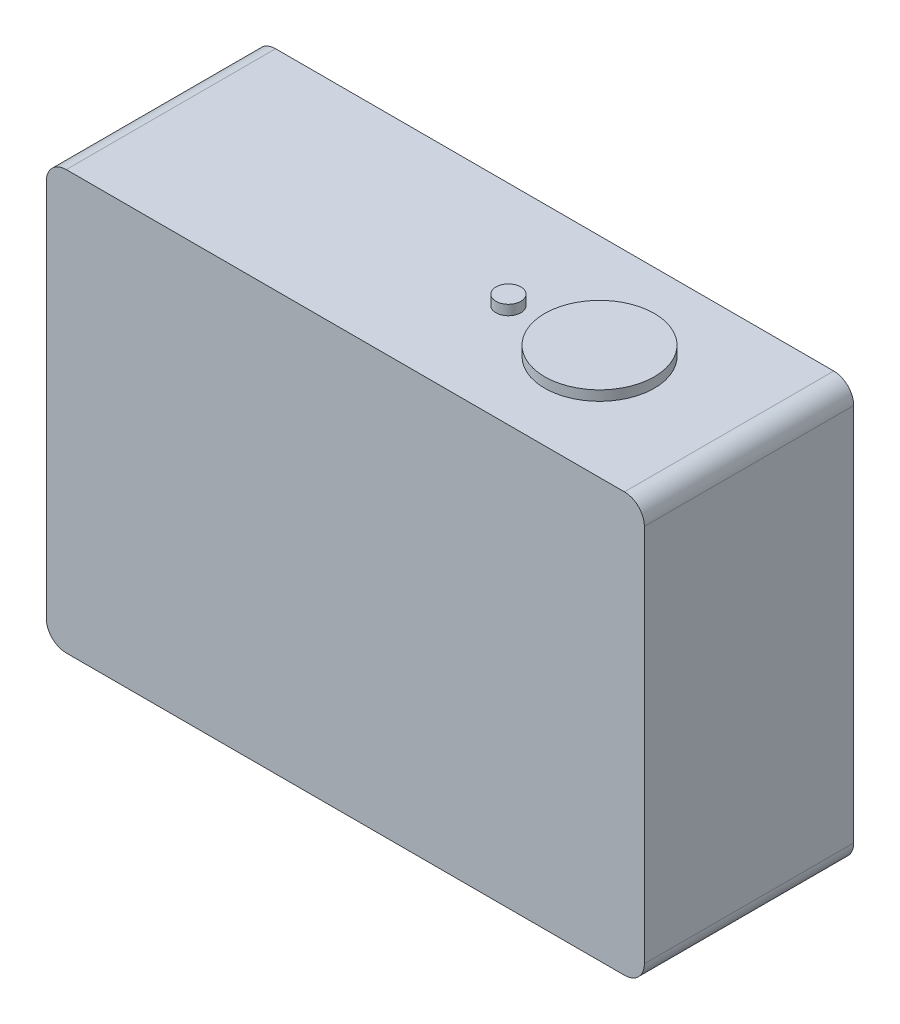
ISO-10303-21;
HEADER;
FILE_DESCRIPTION(('STEP AP214'),'2;1');
FILE_NAME('part.step','',(''),(''),'','','');
FILE_SCHEMA(('AUTOMOTIVE_DESIGN { 1 0 10303 214 1 1 1 1 }'));
ENDSEC;
DATA;
#1=APPLICATION_CONTEXT('core data for automotive mechanical design processes');
#2=APPLICATION_PROTOCOL_DEFINITION('international standard','automotive_design',2000,#1);
#3=PRODUCT_CONTEXT('',#1,'mechanical');
#4=PRODUCT('Part','Part','',(#3));
#5=PRODUCT_RELATED_PRODUCT_CATEGORY('part','',(#4));
#6=PRODUCT_DEFINITION_FORMATION('','',#4);
#7=PRODUCT_DEFINITION_CONTEXT('part definition',#1,'design');
#8=PRODUCT_DEFINITION('design','',#6,#7);
#9=PRODUCT_DEFINITION_SHAPE('','',#8);
#10=(LENGTH_UNIT() NAMED_UNIT(*) SI_UNIT(.MILLI.,.METRE.));
#11=(NAMED_UNIT(*) PLANE_ANGLE_UNIT() SI_UNIT($,.RADIAN.));
#12=(NAMED_UNIT(*) SI_UNIT($,.STERADIAN.) SOLID_ANGLE_UNIT());
#13=UNCERTAINTY_MEASURE_WITH_UNIT(LENGTH_MEASURE(1.E-05),#10,'distance_accuracy_value','');
#14=(GEOMETRIC_REPRESENTATION_CONTEXT(3) GLOBAL_UNCERTAINTY_ASSIGNED_CONTEXT((#13)) GLOBAL_UNIT_ASSIGNED_CONTEXT((#10,
#11,#12)) REPRESENTATION_CONTEXT('',''));
#15=CARTESIAN_POINT('',(0.,0.,0.));
#16=DIRECTION('',(0.,0.,1.));
#17=DIRECTION('',(1.,0.,0.));
#18=AXIS2_PLACEMENT_3D('',#15,#16,#17);
#19=CARTESIAN_POINT('',(30.,-21.,21.));
#20=DIRECTION('',(-1.,0.,0.));
#21=DIRECTION('',(0.,0.,1.));
#22=AXIS2_PLACEMENT_3D('',#19,#20,#21);
#23=PLANE('',#22);
#24=DIRECTION('',(0.,1.,0.));
#25=VECTOR('',#24,1.);
#26=CARTESIAN_POINT('',(30.,-21.,21.));
#27=LINE('',#26,#25);
#28=CARTESIAN_POINT('',(30.,-19.,21.));
#29=VERTEX_POINT('',#28);
#30=CARTESIAN_POINT('',(30.,19.,21.));
#31=VERTEX_POINT('',#30);
#32=EDGE_CURVE('E128',#29,#31,#27,.T.);
#33=ORIENTED_EDGE('',*,*,#32,.F.);
#34=DIRECTION('',(0.,0.,-1.));
#35=VECTOR('',#34,1.);
#36=CARTESIAN_POINT('',(30.,-19.,21.));
#37=LINE('',#36,#35);
#38=CARTESIAN_POINT('',(30.,-19.,0.));
#39=VERTEX_POINT('',#38);
#40=EDGE_CURVE('E154',#29,#39,#37,.T.);
#41=ORIENTED_EDGE('',*,*,#40,.T.);
#42=DIRECTION('',(0.,1.,0.));
#43=VECTOR('',#42,1.);
#44=CARTESIAN_POINT('',(30.,-21.,0.));
#45=LINE('',#44,#43);
#46=CARTESIAN_POINT('',(30.,19.,0.));
#47=VERTEX_POINT('',#46);
#48=EDGE_CURVE('E186',#39,#47,#45,.T.);
#49=ORIENTED_EDGE('',*,*,#48,.T.);
#50=DIRECTION('',(0.,0.,-1.));
#51=VECTOR('',#50,1.);
#52=CARTESIAN_POINT('',(30.,19.,21.));
#53=LINE('',#52,#51);
#54=EDGE_CURVE('E152',#47,#31,#53,.F.);
#55=ORIENTED_EDGE('',*,*,#54,.T.);
#56=EDGE_LOOP('',(#33,#41,#49,#55));
#57=FACE_BOUND('',#56,.T.);
#58=ADVANCED_FACE('F35',(#57),#23,.F.);
#59=CARTESIAN_POINT('',(-30.,21.,21.));
#60=DIRECTION('',(0.,-1.,0.));
#61=DIRECTION('',(0.,0.,-1.));
#62=AXIS2_PLACEMENT_3D('',#59,#60,#61);
#63=PLANE('',#62);
#64=CARTESIAN_POINT('',(6.,21.,10.6398914084365));
#65=DIRECTION('',(0.,-1.,0.));
#66=DIRECTION('',(0.,0.,-1.));
#67=AXIS2_PLACEMENT_3D('',#64,#65,#66);
#68=CIRCLE('',#67,1.25);
#69=CARTESIAN_POINT('',(6.,21.,9.38989140843655));
#70=VERTEX_POINT('',#69);
#71=EDGE_CURVE('E43',#70,#70,#68,.F.);
#72=ORIENTED_EDGE('',*,*,#71,.F.);
#73=EDGE_LOOP('',(#72));
#74=FACE_BOUND('',#73,.T.);
#75=CARTESIAN_POINT('',(15.,21.,10.5));
#76=DIRECTION('',(0.,-1.,0.));
#77=DIRECTION('',(0.,0.,-1.));
#78=AXIS2_PLACEMENT_3D('',#75,#76,#77);
#79=CIRCLE('',#78,5.5);
#80=CARTESIAN_POINT('',(15.,21.,5.));
#81=VERTEX_POINT('',#80);
#82=EDGE_CURVE('E164',#81,#81,#79,.F.);
#83=ORIENTED_EDGE('',*,*,#82,.F.);
#84=EDGE_LOOP('',(#83));
#85=FACE_BOUND('',#84,.T.);
#86=DIRECTION('',(-1.,0.,0.));
#87=VECTOR('',#86,1.);
#88=CARTESIAN_POINT('',(-30.,21.,21.));
#89=LINE('',#88,#87);
#90=CARTESIAN_POINT('',(28.,21.,21.));
#91=VERTEX_POINT('',#90);
#92=CARTESIAN_POINT('',(-28.,21.,21.));
#93=VERTEX_POINT('',#92);
#94=EDGE_CURVE('E131',#91,#93,#89,.T.);
#95=ORIENTED_EDGE('',*,*,#94,.F.);
#96=DIRECTION('',(0.,0.,-1.));
#97=VECTOR('',#96,1.);
#98=CARTESIAN_POINT('',(28.,21.,21.));
#99=LINE('',#98,#97);
#100=CARTESIAN_POINT('',(28.,21.,0.));
#101=VERTEX_POINT('',#100);
#102=EDGE_CURVE('E158',#91,#101,#99,.T.);
#103=ORIENTED_EDGE('',*,*,#102,.T.);
#104=DIRECTION('',(-1.,0.,0.));
#105=VECTOR('',#104,1.);
#106=CARTESIAN_POINT('',(-30.,21.,0.));
#107=LINE('',#106,#105);
#108=CARTESIAN_POINT('',(-28.,21.,0.));
#109=VERTEX_POINT('',#108);
#110=EDGE_CURVE('E133',#101,#109,#107,.T.);
#111=ORIENTED_EDGE('',*,*,#110,.T.);
#112=DIRECTION('',(0.,0.,-1.));
#113=VECTOR('',#112,1.);
#114=CARTESIAN_POINT('',(-28.,21.,21.));
#115=LINE('',#114,#113);
#116=EDGE_CURVE('E50',#109,#93,#115,.F.);
#117=ORIENTED_EDGE('',*,*,#116,.T.);
#118=EDGE_LOOP('',(#95,#103,#111,#117));
#119=FACE_BOUND('',#118,.T.);
#120=ADVANCED_FACE('F171',(#74,#85,#119),#63,.F.);
#121=CARTESIAN_POINT('',(-30.,-21.,21.));
#122=DIRECTION('',(1.,0.,0.));
#123=DIRECTION('',(0.,0.,-1.));
#124=AXIS2_PLACEMENT_3D('',#121,#122,#123);
#125=PLANE('',#124);
#126=DIRECTION('',(0.,-1.,0.));
#127=VECTOR('',#126,1.);
#128=CARTESIAN_POINT('',(-30.,-21.,0.));
#129=LINE('',#128,#127);
#130=CARTESIAN_POINT('',(-30.,19.,0.));
#131=VERTEX_POINT('',#130);
#132=CARTESIAN_POINT('',(-30.,-19.,0.));
#133=VERTEX_POINT('',#132);
#134=EDGE_CURVE('E129',#131,#133,#129,.T.);
#135=ORIENTED_EDGE('',*,*,#134,.T.);
#136=DIRECTION('',(0.,0.,-1.));
#137=VECTOR('',#136,1.);
#138=CARTESIAN_POINT('',(-30.,-19.,21.));
#139=LINE('',#138,#137);
#140=CARTESIAN_POINT('',(-30.,-19.,21.));
#141=VERTEX_POINT('',#140);
#142=EDGE_CURVE('E107',#133,#141,#139,.F.);
#143=ORIENTED_EDGE('',*,*,#142,.T.);
#144=DIRECTION('',(0.,-1.,0.));
#145=VECTOR('',#144,1.);
#146=CARTESIAN_POINT('',(-30.,-21.,21.));
#147=LINE('',#146,#145);
#148=CARTESIAN_POINT('',(-30.,19.,21.));
#149=VERTEX_POINT('',#148);
#150=EDGE_CURVE('E180',#149,#141,#147,.T.);
#151=ORIENTED_EDGE('',*,*,#150,.F.);
#152=DIRECTION('',(0.,0.,-1.));
#153=VECTOR('',#152,1.);
#154=CARTESIAN_POINT('',(-30.,19.,21.));
#155=LINE('',#154,#153);
#156=EDGE_CURVE('E112',#149,#131,#155,.T.);
#157=ORIENTED_EDGE('',*,*,#156,.T.);
#158=EDGE_LOOP('',(#135,#143,#151,#157));
#159=FACE_BOUND('',#158,.T.);
#160=ADVANCED_FACE('F174',(#159),#125,.F.);
#161=CARTESIAN_POINT('',(-30.,-21.,21.));
#162=DIRECTION('',(0.,1.,0.));
#163=DIRECTION('',(0.,0.,1.));
#164=AXIS2_PLACEMENT_3D('',#161,#162,#163);
#165=PLANE('',#164);
#166=DIRECTION('',(1.,0.,0.));
#167=VECTOR('',#166,1.);
#168=CARTESIAN_POINT('',(-30.,-21.,21.));
#169=LINE('',#168,#167);
#170=CARTESIAN_POINT('',(-28.,-21.,21.));
#171=VERTEX_POINT('',#170);
#172=CARTESIAN_POINT('',(28.,-21.,21.));
#173=VERTEX_POINT('',#172);
#174=EDGE_CURVE('E122',#171,#173,#169,.T.);
#175=ORIENTED_EDGE('',*,*,#174,.F.);
#176=DIRECTION('',(0.,0.,-1.));
#177=VECTOR('',#176,1.);
#178=CARTESIAN_POINT('',(-28.,-21.,21.));
#179=LINE('',#178,#177);
#180=CARTESIAN_POINT('',(-28.,-21.,0.));
#181=VERTEX_POINT('',#180);
#182=EDGE_CURVE('E106',#171,#181,#179,.T.);
#183=ORIENTED_EDGE('',*,*,#182,.T.);
#184=DIRECTION('',(1.,0.,0.));
#185=VECTOR('',#184,1.);
#186=CARTESIAN_POINT('',(-30.,-21.,0.));
#187=LINE('',#186,#185);
#188=CARTESIAN_POINT('',(28.,-21.,0.));
#189=VERTEX_POINT('',#188);
#190=EDGE_CURVE('E119',#181,#189,#187,.T.);
#191=ORIENTED_EDGE('',*,*,#190,.T.);
#192=DIRECTION('',(0.,0.,-1.));
#193=VECTOR('',#192,1.);
#194=CARTESIAN_POINT('',(28.,-21.,21.));
#195=LINE('',#194,#193);
#196=EDGE_CURVE('E124',#189,#173,#195,.F.);
#197=ORIENTED_EDGE('',*,*,#196,.T.);
#198=EDGE_LOOP('',(#175,#183,#191,#197));
#199=FACE_BOUND('',#198,.T.);
#200=ADVANCED_FACE('F118',(#199),#165,.F.);
#201=CARTESIAN_POINT('',(0.,0.,21.));
#202=DIRECTION('',(0.,0.,-1.));
#203=DIRECTION('',(-1.,0.,0.));
#204=AXIS2_PLACEMENT_3D('',#201,#202,#203);
#205=PLANE('',#204);
#206=ORIENTED_EDGE('',*,*,#150,.T.);
#207=CARTESIAN_POINT('',(-28.,-19.,21.));
#208=DIRECTION('',(0.,0.,-1.));
#209=DIRECTION('',(-1.,0.,0.));
#210=AXIS2_PLACEMENT_3D('',#207,#208,#209);
#211=CIRCLE('',#210,2.);
#212=EDGE_CURVE('E150',#141,#171,#211,.F.);
#213=ORIENTED_EDGE('',*,*,#212,.T.);
#214=ORIENTED_EDGE('',*,*,#174,.T.);
#215=CARTESIAN_POINT('',(28.,-19.,21.));
#216=DIRECTION('',(0.,0.,-1.));
#217=DIRECTION('',(-1.,0.,0.));
#218=AXIS2_PLACEMENT_3D('',#215,#216,#217);
#219=CIRCLE('',#218,2.);
#220=EDGE_CURVE('E148',#173,#29,#219,.F.);
#221=ORIENTED_EDGE('',*,*,#220,.T.);
#222=ORIENTED_EDGE('',*,*,#32,.T.);
#223=CARTESIAN_POINT('',(28.,19.,21.));
#224=DIRECTION('',(0.,0.,-1.));
#225=DIRECTION('',(-1.,0.,0.));
#226=AXIS2_PLACEMENT_3D('',#223,#224,#225);
#227=CIRCLE('',#226,2.);
#228=EDGE_CURVE('E57',#31,#91,#227,.F.);
#229=ORIENTED_EDGE('',*,*,#228,.T.);
#230=ORIENTED_EDGE('',*,*,#94,.T.);
#231=CARTESIAN_POINT('',(-28.,19.,21.));
#232=DIRECTION('',(0.,0.,-1.));
#233=DIRECTION('',(-1.,0.,0.));
#234=AXIS2_PLACEMENT_3D('',#231,#232,#233);
#235=CIRCLE('',#234,2.);
#236=EDGE_CURVE('E145',#93,#149,#235,.F.);
#237=ORIENTED_EDGE('',*,*,#236,.T.);
#238=EDGE_LOOP('',(#206,#213,#214,#221,#222,#229,#230,#237));
#239=FACE_BOUND('',#238,.T.);
#240=ADVANCED_FACE('F253',(#239),#205,.F.);
#241=CARTESIAN_POINT('',(0.,0.,0.));
#242=DIRECTION('',(0.,0.,-1.));
#243=DIRECTION('',(-1.,0.,0.));
#244=AXIS2_PLACEMENT_3D('',#241,#242,#243);
#245=PLANE('',#244);
#246=CARTESIAN_POINT('',(15.,0.,0.));
#247=DIRECTION('',(0.,0.,-1.));
#248=DIRECTION('',(-1.,0.,0.));
#249=AXIS2_PLACEMENT_3D('',#246,#247,#248);
#250=CIRCLE('',#249,7.41919465019523);
#251=CARTESIAN_POINT('',(7.58080534980477,0.,0.));
#252=VERTEX_POINT('',#251);
#253=EDGE_CURVE('E161',#252,#252,#250,.T.);
#254=ORIENTED_EDGE('',*,*,#253,.F.);
#255=EDGE_LOOP('',(#254));
#256=FACE_BOUND('',#255,.T.);
#257=CARTESIAN_POINT('',(-13.,0.,0.));
#258=DIRECTION('',(0.,0.,-1.));
#259=DIRECTION('',(-1.,0.,0.));
#260=AXIS2_PLACEMENT_3D('',#257,#258,#259);
#261=CIRCLE('',#260,11.875268611466);
#262=CARTESIAN_POINT('',(-24.875268611466,0.,0.));
#263=VERTEX_POINT('',#262);
#264=EDGE_CURVE('E193',#263,#263,#261,.T.);
#265=ORIENTED_EDGE('',*,*,#264,.F.);
#266=EDGE_LOOP('',(#265));
#267=FACE_BOUND('',#266,.T.);
#268=ORIENTED_EDGE('',*,*,#190,.F.);
#269=CARTESIAN_POINT('',(-28.,-19.,0.));
#270=DIRECTION('',(0.,0.,-1.));
#271=DIRECTION('',(-1.,0.,0.));
#272=AXIS2_PLACEMENT_3D('',#269,#270,#271);
#273=CIRCLE('',#272,2.);
#274=EDGE_CURVE('E102',#181,#133,#273,.T.);
#275=ORIENTED_EDGE('',*,*,#274,.T.);
#276=ORIENTED_EDGE('',*,*,#134,.F.);
#277=CARTESIAN_POINT('',(-28.,19.,0.));
#278=DIRECTION('',(0.,0.,-1.));
#279=DIRECTION('',(-1.,0.,0.));
#280=AXIS2_PLACEMENT_3D('',#277,#278,#279);
#281=CIRCLE('',#280,2.);
#282=EDGE_CURVE('E123',#131,#109,#281,.T.);
#283=ORIENTED_EDGE('',*,*,#282,.T.);
#284=ORIENTED_EDGE('',*,*,#110,.F.);
#285=CARTESIAN_POINT('',(28.,19.,0.));
#286=DIRECTION('',(0.,0.,-1.));
#287=DIRECTION('',(-1.,0.,0.));
#288=AXIS2_PLACEMENT_3D('',#285,#286,#287);
#289=CIRCLE('',#288,2.);
#290=EDGE_CURVE('E139',#101,#47,#289,.T.);
#291=ORIENTED_EDGE('',*,*,#290,.T.);
#292=ORIENTED_EDGE('',*,*,#48,.F.);
#293=CARTESIAN_POINT('',(28.,-19.,0.));
#294=DIRECTION('',(0.,0.,-1.));
#295=DIRECTION('',(-1.,0.,0.));
#296=AXIS2_PLACEMENT_3D('',#293,#294,#295);
#297=CIRCLE('',#296,2.);
#298=EDGE_CURVE('E113',#39,#189,#297,.T.);
#299=ORIENTED_EDGE('',*,*,#298,.T.);
#300=EDGE_LOOP('',(#268,#275,#276,#283,#284,#291,#292,#299));
#301=FACE_BOUND('',#300,.T.);
#302=ADVANCED_FACE('F126',(#256,#267,#301),#245,.T.);
#303=CARTESIAN_POINT('',(-28.,-19.,21.));
#304=DIRECTION('',(0.,0.,-1.));
#305=DIRECTION('',(-1.,0.,0.));
#306=AXIS2_PLACEMENT_3D('',#303,#304,#305);
#307=CYLINDRICAL_SURFACE('',#306,2.);
#308=ORIENTED_EDGE('',*,*,#212,.F.);
#309=ORIENTED_EDGE('',*,*,#142,.F.);
#310=ORIENTED_EDGE('',*,*,#274,.F.);
#311=ORIENTED_EDGE('',*,*,#182,.F.);
#312=EDGE_LOOP('',(#308,#309,#310,#311));
#313=FACE_BOUND('',#312,.T.);
#314=ADVANCED_FACE('F105',(#313),#307,.T.);
#315=CARTESIAN_POINT('',(28.,-19.,21.));
#316=DIRECTION('',(0.,0.,-1.));
#317=DIRECTION('',(-1.,0.,0.));
#318=AXIS2_PLACEMENT_3D('',#315,#316,#317);
#319=CYLINDRICAL_SURFACE('',#318,2.);
#320=ORIENTED_EDGE('',*,*,#220,.F.);
#321=ORIENTED_EDGE('',*,*,#196,.F.);
#322=ORIENTED_EDGE('',*,*,#298,.F.);
#323=ORIENTED_EDGE('',*,*,#40,.F.);
#324=EDGE_LOOP('',(#320,#321,#322,#323));
#325=FACE_BOUND('',#324,.T.);
#326=ADVANCED_FACE('F236',(#325),#319,.T.);
#327=CARTESIAN_POINT('',(28.,19.,21.));
#328=DIRECTION('',(0.,0.,-1.));
#329=DIRECTION('',(-1.,0.,0.));
#330=AXIS2_PLACEMENT_3D('',#327,#328,#329);
#331=CYLINDRICAL_SURFACE('',#330,2.);
#332=ORIENTED_EDGE('',*,*,#228,.F.);
#333=ORIENTED_EDGE('',*,*,#54,.F.);
#334=ORIENTED_EDGE('',*,*,#290,.F.);
#335=ORIENTED_EDGE('',*,*,#102,.F.);
#336=EDGE_LOOP('',(#332,#333,#334,#335));
#337=FACE_BOUND('',#336,.T.);
#338=ADVANCED_FACE('F183',(#337),#331,.T.);
#339=CARTESIAN_POINT('',(-28.,19.,21.));
#340=DIRECTION('',(0.,0.,-1.));
#341=DIRECTION('',(-1.,0.,0.));
#342=AXIS2_PLACEMENT_3D('',#339,#340,#341);
#343=CYLINDRICAL_SURFACE('',#342,2.);
#344=ORIENTED_EDGE('',*,*,#236,.F.);
#345=ORIENTED_EDGE('',*,*,#116,.F.);
#346=ORIENTED_EDGE('',*,*,#282,.F.);
#347=ORIENTED_EDGE('',*,*,#156,.F.);
#348=EDGE_LOOP('',(#344,#345,#346,#347));
#349=FACE_BOUND('',#348,.T.);
#350=ADVANCED_FACE('F37',(#349),#343,.T.);
#351=CARTESIAN_POINT('',(-13.,0.,-7.5));
#352=DIRECTION('',(0.,0.,-1.));
#353=DIRECTION('',(-1.,0.,0.));
#354=AXIS2_PLACEMENT_3D('',#351,#352,#353);
#355=PLANE('',#354);
#356=CARTESIAN_POINT('',(-13.,0.,-7.5));
#357=DIRECTION('',(0.,0.,-1.));
#358=DIRECTION('',(-1.,0.,0.));
#359=AXIS2_PLACEMENT_3D('',#356,#357,#358);
#360=CIRCLE('',#359,11.875268611466);
#361=CARTESIAN_POINT('',(-24.875268611466,0.,-7.5));
#362=VERTEX_POINT('',#361);
#363=EDGE_CURVE('E190',#362,#362,#360,.T.);
#364=ORIENTED_EDGE('',*,*,#363,.T.);
#365=EDGE_LOOP('',(#364));
#366=FACE_BOUND('',#365,.T.);
#367=CARTESIAN_POINT('',(-13.,0.,-7.5));
#368=DIRECTION('',(0.,0.,-1.));
#369=DIRECTION('',(-1.,0.,0.));
#370=AXIS2_PLACEMENT_3D('',#367,#368,#369);
#371=CIRCLE('',#370,8.87290752289096);
#372=CARTESIAN_POINT('',(-21.872907522891,0.,-7.5));
#373=VERTEX_POINT('',#372);
#374=EDGE_CURVE('E200',#373,#373,#371,.T.);
#375=ORIENTED_EDGE('',*,*,#374,.F.);
#376=EDGE_LOOP('',(#375));
#377=FACE_BOUND('',#376,.T.);
#378=ADVANCED_FACE('F243',(#366,#377),#355,.T.);
#379=CARTESIAN_POINT('',(-13.,0.,-7.5));
#380=DIRECTION('',(0.,0.,1.));
#381=DIRECTION('',(1.,0.,0.));
#382=AXIS2_PLACEMENT_3D('',#379,#380,#381);
#383=CYLINDRICAL_SURFACE('',#382,11.875268611466);
#384=ORIENTED_EDGE('',*,*,#363,.F.);
#385=EDGE_LOOP('',(#384));
#386=FACE_BOUND('',#385,.T.);
#387=ORIENTED_EDGE('',*,*,#264,.T.);
#388=EDGE_LOOP('',(#387));
#389=FACE_BOUND('',#388,.T.);
#390=ADVANCED_FACE('F248',(#386,#389),#383,.T.);
#391=CARTESIAN_POINT('',(-13.,0.,-7.5));
#392=DIRECTION('',(0.,0.,1.));
#393=DIRECTION('',(1.,0.,0.));
#394=AXIS2_PLACEMENT_3D('',#391,#392,#393);
#395=CYLINDRICAL_SURFACE('',#394,8.87290752289096);
#396=CARTESIAN_POINT('',(-13.,0.,-4.));
#397=DIRECTION('',(0.,0.,-1.));
#398=DIRECTION('',(-1.,0.,0.));
#399=AXIS2_PLACEMENT_3D('',#396,#397,#398);
#400=CIRCLE('',#399,8.87290752289096);
#401=CARTESIAN_POINT('',(-21.872907522891,0.,-4.));
#402=VERTEX_POINT('',#401);
#403=EDGE_CURVE('E11',#402,#402,#400,.T.);
#404=ORIENTED_EDGE('',*,*,#403,.F.);
#405=EDGE_LOOP('',(#404));
#406=FACE_BOUND('',#405,.T.);
#407=ORIENTED_EDGE('',*,*,#374,.T.);
#408=EDGE_LOOP('',(#407));
#409=FACE_BOUND('',#408,.T.);
#410=ADVANCED_FACE('F267',(#406,#409),#395,.F.);
#411=CARTESIAN_POINT('',(15.,0.,-2.));
#412=DIRECTION('',(0.,0.,1.));
#413=DIRECTION('',(1.,0.,0.));
#414=AXIS2_PLACEMENT_3D('',#411,#412,#413);
#415=CYLINDRICAL_SURFACE('',#414,7.41919465019523);
#416=CARTESIAN_POINT('',(15.,0.,-2.));
#417=DIRECTION('',(0.,0.,1.));
#418=DIRECTION('',(1.,0.,0.));
#419=AXIS2_PLACEMENT_3D('',#416,#417,#418);
#420=CIRCLE('',#419,7.41919465019523);
#421=CARTESIAN_POINT('',(22.4191946501952,0.,-2.));
#422=VERTEX_POINT('',#421);
#423=EDGE_CURVE('E204',#422,#422,#420,.T.);
#424=ORIENTED_EDGE('',*,*,#423,.T.);
#425=EDGE_LOOP('',(#424));
#426=FACE_BOUND('',#425,.T.);
#427=ORIENTED_EDGE('',*,*,#253,.T.);
#428=EDGE_LOOP('',(#427));
#429=FACE_BOUND('',#428,.T.);
#430=ADVANCED_FACE('F272',(#426,#429),#415,.T.);
#431=CARTESIAN_POINT('',(15.,0.,-2.));
#432=DIRECTION('',(0.,0.,1.));
#433=DIRECTION('',(1.,0.,0.));
#434=AXIS2_PLACEMENT_3D('',#431,#432,#433);
#435=PLANE('',#434);
#436=ORIENTED_EDGE('',*,*,#423,.F.);
#437=EDGE_LOOP('',(#436));
#438=FACE_BOUND('',#437,.T.);
#439=ADVANCED_FACE('F276',(#438),#435,.F.);
#440=CARTESIAN_POINT('',(15.,22.,10.5));
#441=DIRECTION('',(0.,-1.,0.));
#442=DIRECTION('',(0.,0.,-1.));
#443=AXIS2_PLACEMENT_3D('',#440,#441,#442);
#444=CYLINDRICAL_SURFACE('',#443,5.5);
#445=CARTESIAN_POINT('',(15.,22.,10.5));
#446=DIRECTION('',(0.,1.,0.));
#447=DIRECTION('',(0.,0.,1.));
#448=AXIS2_PLACEMENT_3D('',#445,#446,#447);
#449=CIRCLE('',#448,5.5);
#450=CARTESIAN_POINT('',(15.,22.,16.));
#451=VERTEX_POINT('',#450);
#452=EDGE_CURVE('E207',#451,#451,#449,.T.);
#453=ORIENTED_EDGE('',*,*,#452,.F.);
#454=EDGE_LOOP('',(#453));
#455=FACE_BOUND('',#454,.T.);
#456=ORIENTED_EDGE('',*,*,#82,.T.);
#457=EDGE_LOOP('',(#456));
#458=FACE_BOUND('',#457,.T.);
#459=ADVANCED_FACE('F225',(#455,#458),#444,.T.);
#460=CARTESIAN_POINT('',(15.,22.,10.5));
#461=DIRECTION('',(0.,1.,0.));
#462=DIRECTION('',(0.,0.,1.));
#463=AXIS2_PLACEMENT_3D('',#460,#461,#462);
#464=PLANE('',#463);
#465=ORIENTED_EDGE('',*,*,#452,.T.);
#466=EDGE_LOOP('',(#465));
#467=FACE_BOUND('',#466,.T.);
#468=ADVANCED_FACE('F217',(#467),#464,.T.);
#469=CARTESIAN_POINT('',(6.,22.,10.6398914084365));
#470=DIRECTION('',(0.,-1.,0.));
#471=DIRECTION('',(0.,0.,-1.));
#472=AXIS2_PLACEMENT_3D('',#469,#470,#471);
#473=CYLINDRICAL_SURFACE('',#472,1.25);
#474=CARTESIAN_POINT('',(6.,22.,10.6398914084365));
#475=DIRECTION('',(0.,1.,0.));
#476=DIRECTION('',(0.,0.,1.));
#477=AXIS2_PLACEMENT_3D('',#474,#475,#476);
#478=CIRCLE('',#477,1.25);
#479=CARTESIAN_POINT('',(6.,22.,11.8898914084365));
#480=VERTEX_POINT('',#479);
#481=EDGE_CURVE('E210',#480,#480,#478,.T.);
#482=ORIENTED_EDGE('',*,*,#481,.F.);
#483=EDGE_LOOP('',(#482));
#484=FACE_BOUND('',#483,.T.);
#485=ORIENTED_EDGE('',*,*,#71,.T.);
#486=EDGE_LOOP('',(#485));
#487=FACE_BOUND('',#486,.T.);
#488=ADVANCED_FACE('F169',(#484,#487),#473,.T.);
#489=CARTESIAN_POINT('',(6.,22.,10.6398914084365));
#490=DIRECTION('',(0.,1.,0.));
#491=DIRECTION('',(0.,0.,1.));
#492=AXIS2_PLACEMENT_3D('',#489,#490,#491);
#493=PLANE('',#492);
#494=ORIENTED_EDGE('',*,*,#481,.T.);
#495=EDGE_LOOP('',(#494));
#496=FACE_BOUND('',#495,.T.);
#497=ADVANCED_FACE('F214',(#496),#493,.T.);
#498=CARTESIAN_POINT('',(-13.,0.,-4.));
#499=DIRECTION('',(0.,0.,-1.));
#500=DIRECTION('',(-1.,0.,0.));
#501=AXIS2_PLACEMENT_3D('',#498,#499,#500);
#502=PLANE('',#501);
#503=ORIENTED_EDGE('',*,*,#403,.T.);
#504=EDGE_LOOP('',(#503));
#505=FACE_BOUND('',#504,.T.);
#506=ADVANCED_FACE('F223',(#505),#502,.T.);
#507=CLOSED_SHELL('',(#58,#120,#160,#200,#240,#302,#314,#326,#338,#350,#378,#390,#410,#430,#439,
#459,#468,#488,#497,#506));
#508=MANIFOLD_SOLID_BREP('B2',#507);
#509=ADVANCED_BREP_SHAPE_REPRESENTATION('',(#18,#508),#14);
#510=SHAPE_DEFINITION_REPRESENTATION(#9,#509);
ENDSEC;
END-ISO-10303-21;
